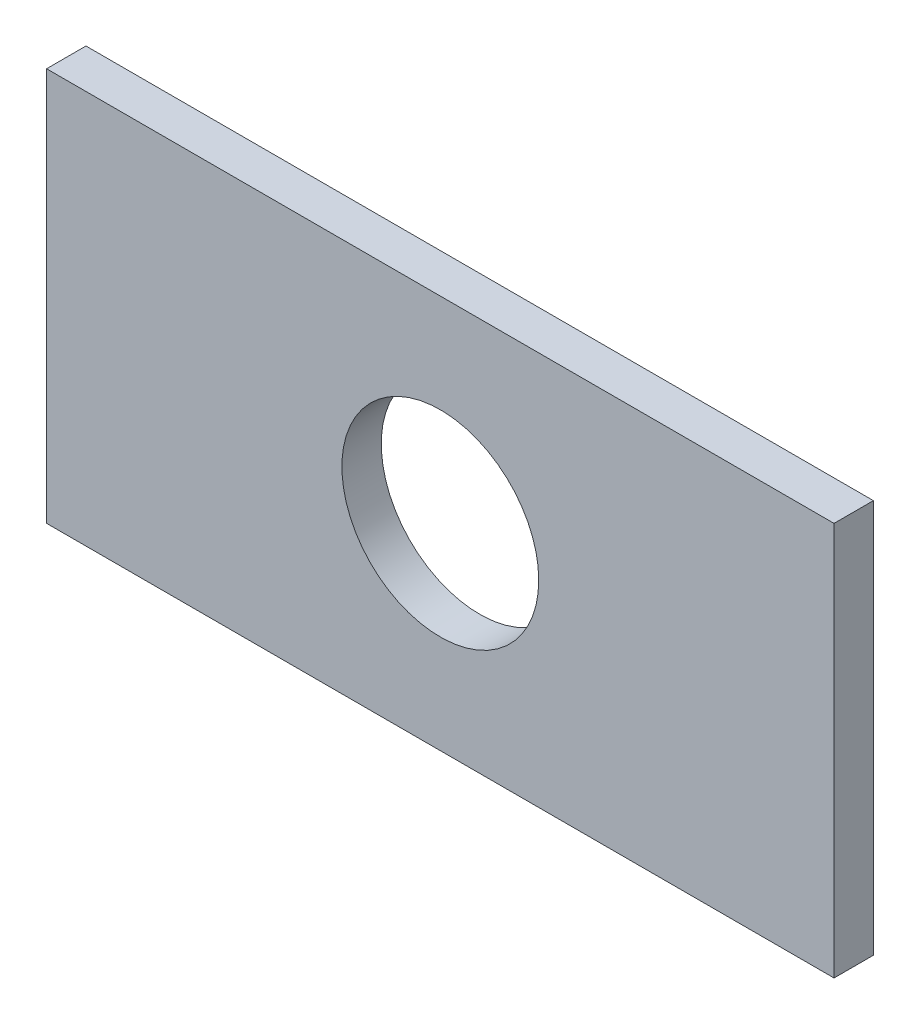
ISO-10303-21;
HEADER;
FILE_DESCRIPTION(('STEP AP214'),'2;1');
FILE_NAME('part.step','',(''),(''),'','','');
FILE_SCHEMA(('AUTOMOTIVE_DESIGN { 1 0 10303 214 1 1 1 1 }'));
ENDSEC;
DATA;
#1=APPLICATION_CONTEXT('core data for automotive mechanical design processes');
#2=APPLICATION_PROTOCOL_DEFINITION('international standard','automotive_design',2000,#1);
#3=PRODUCT_CONTEXT('',#1,'mechanical');
#4=PRODUCT('Part','Part','',(#3));
#5=PRODUCT_RELATED_PRODUCT_CATEGORY('part','',(#4));
#6=PRODUCT_DEFINITION_FORMATION('','',#4);
#7=PRODUCT_DEFINITION_CONTEXT('part definition',#1,'design');
#8=PRODUCT_DEFINITION('design','',#6,#7);
#9=PRODUCT_DEFINITION_SHAPE('','',#8);
#10=(LENGTH_UNIT() NAMED_UNIT(*) SI_UNIT(.MILLI.,.METRE.));
#11=(NAMED_UNIT(*) PLANE_ANGLE_UNIT() SI_UNIT($,.RADIAN.));
#12=(NAMED_UNIT(*) SI_UNIT($,.STERADIAN.) SOLID_ANGLE_UNIT());
#13=UNCERTAINTY_MEASURE_WITH_UNIT(LENGTH_MEASURE(1.E-05),#10,'distance_accuracy_value','');
#14=(GEOMETRIC_REPRESENTATION_CONTEXT(3) GLOBAL_UNCERTAINTY_ASSIGNED_CONTEXT((#13)) GLOBAL_UNIT_ASSIGNED_CONTEXT((#10,
#11,#12)) REPRESENTATION_CONTEXT('',''));
#15=CARTESIAN_POINT('',(0.,0.,0.));
#16=DIRECTION('',(0.,0.,1.));
#17=DIRECTION('',(1.,0.,0.));
#18=AXIS2_PLACEMENT_3D('',#15,#16,#17);
#19=CARTESIAN_POINT('',(0.,0.,127.));
#20=DIRECTION('',(0.,0.,-1.));
#21=DIRECTION('',(-1.,0.,0.));
#22=AXIS2_PLACEMENT_3D('',#19,#20,#21);
#23=PLANE('',#22);
#24=DIRECTION('',(0.,-1.,0.));
#25=VECTOR('',#24,1.);
#26=CARTESIAN_POINT('',(-2540.,1270.,127.));
#27=LINE('',#26,#25);
#28=CARTESIAN_POINT('',(-2540.,1270.,127.));
#29=VERTEX_POINT('',#28);
#30=CARTESIAN_POINT('',(-2540.,-1270.,127.));
#31=VERTEX_POINT('',#30);
#32=EDGE_CURVE('E85',#29,#31,#27,.T.);
#33=ORIENTED_EDGE('',*,*,#32,.T.);
#34=DIRECTION('',(1.,0.,0.));
#35=VECTOR('',#34,1.);
#36=CARTESIAN_POINT('',(2540.,-1270.,127.));
#37=LINE('',#36,#35);
#38=CARTESIAN_POINT('',(2540.,-1270.,127.));
#39=VERTEX_POINT('',#38);
#40=EDGE_CURVE('E80',#31,#39,#37,.T.);
#41=ORIENTED_EDGE('',*,*,#40,.T.);
#42=DIRECTION('',(0.,1.,0.));
#43=VECTOR('',#42,1.);
#44=CARTESIAN_POINT('',(2540.,1270.,127.));
#45=LINE('',#44,#43);
#46=CARTESIAN_POINT('',(2540.,1270.,127.));
#47=VERTEX_POINT('',#46);
#48=EDGE_CURVE('E83',#39,#47,#45,.T.);
#49=ORIENTED_EDGE('',*,*,#48,.T.);
#50=DIRECTION('',(-1.,0.,0.));
#51=VECTOR('',#50,1.);
#52=CARTESIAN_POINT('',(2540.,1270.,127.));
#53=LINE('',#52,#51);
#54=EDGE_CURVE('E50',#47,#29,#53,.T.);
#55=ORIENTED_EDGE('',*,*,#54,.T.);
#56=EDGE_LOOP('',(#33,#41,#49,#55));
#57=FACE_BOUND('',#56,.T.);
#58=CARTESIAN_POINT('',(-4.44089209850063E-13,8.88178419700125E-13,127.));
#59=DIRECTION('',(0.,0.,1.));
#60=DIRECTION('',(1.,0.,0.));
#61=AXIS2_PLACEMENT_3D('',#58,#59,#60);
#62=CIRCLE('',#61,635.);
#63=CARTESIAN_POINT('',(635.,8.88178419700125E-13,127.));
#64=VERTEX_POINT('',#63);
#65=EDGE_CURVE('E100',#64,#64,#62,.T.);
#66=ORIENTED_EDGE('',*,*,#65,.F.);
#67=EDGE_LOOP('',(#66));
#68=FACE_BOUND('',#67,.T.);
#69=ADVANCED_FACE('F33',(#57,#68),#23,.F.);
#70=CARTESIAN_POINT('',(0.,0.,-127.));
#71=DIRECTION('',(0.,0.,-1.));
#72=DIRECTION('',(-1.,0.,0.));
#73=AXIS2_PLACEMENT_3D('',#70,#71,#72);
#74=PLANE('',#73);
#75=DIRECTION('',(0.,-1.,0.));
#76=VECTOR('',#75,1.);
#77=CARTESIAN_POINT('',(-2540.,1270.,-127.));
#78=LINE('',#77,#76);
#79=CARTESIAN_POINT('',(-2540.,1270.,-127.));
#80=VERTEX_POINT('',#79);
#81=CARTESIAN_POINT('',(-2540.,-1270.,-127.));
#82=VERTEX_POINT('',#81);
#83=EDGE_CURVE('E97',#80,#82,#78,.T.);
#84=ORIENTED_EDGE('',*,*,#83,.F.);
#85=DIRECTION('',(-1.,0.,0.));
#86=VECTOR('',#85,1.);
#87=CARTESIAN_POINT('',(2540.,1270.,-127.));
#88=LINE('',#87,#86);
#89=CARTESIAN_POINT('',(2540.,1270.,-127.));
#90=VERTEX_POINT('',#89);
#91=EDGE_CURVE('E73',#90,#80,#88,.T.);
#92=ORIENTED_EDGE('',*,*,#91,.F.);
#93=DIRECTION('',(0.,1.,0.));
#94=VECTOR('',#93,1.);
#95=CARTESIAN_POINT('',(2540.,1270.,-127.));
#96=LINE('',#95,#94);
#97=CARTESIAN_POINT('',(2540.,-1270.,-127.));
#98=VERTEX_POINT('',#97);
#99=EDGE_CURVE('E67',#98,#90,#96,.T.);
#100=ORIENTED_EDGE('',*,*,#99,.F.);
#101=DIRECTION('',(1.,0.,0.));
#102=VECTOR('',#101,1.);
#103=CARTESIAN_POINT('',(2540.,-1270.,-127.));
#104=LINE('',#103,#102);
#105=EDGE_CURVE('E89',#82,#98,#104,.T.);
#106=ORIENTED_EDGE('',*,*,#105,.F.);
#107=EDGE_LOOP('',(#84,#92,#100,#106));
#108=FACE_BOUND('',#107,.T.);
#109=CARTESIAN_POINT('',(-4.44089209850063E-13,8.88178419700125E-13,-127.));
#110=DIRECTION('',(0.,0.,1.));
#111=DIRECTION('',(1.,0.,0.));
#112=AXIS2_PLACEMENT_3D('',#109,#110,#111);
#113=CIRCLE('',#112,635.);
#114=CARTESIAN_POINT('',(635.,8.88178419700125E-13,-127.));
#115=VERTEX_POINT('',#114);
#116=EDGE_CURVE('E112',#115,#115,#113,.T.);
#117=ORIENTED_EDGE('',*,*,#116,.T.);
#118=EDGE_LOOP('',(#117));
#119=FACE_BOUND('',#118,.T.);
#120=ADVANCED_FACE('F108',(#108,#119),#74,.T.);
#121=CARTESIAN_POINT('',(-2540.,1270.,127.));
#122=DIRECTION('',(1.,0.,0.));
#123=DIRECTION('',(0.,1.,0.));
#124=AXIS2_PLACEMENT_3D('',#121,#122,#123);
#125=PLANE('',#124);
#126=ORIENTED_EDGE('',*,*,#83,.T.);
#127=DIRECTION('',(0.,0.,-1.));
#128=VECTOR('',#127,1.);
#129=CARTESIAN_POINT('',(-2540.,-1270.,127.));
#130=LINE('',#129,#128);
#131=EDGE_CURVE('E11',#31,#82,#130,.T.);
#132=ORIENTED_EDGE('',*,*,#131,.F.);
#133=ORIENTED_EDGE('',*,*,#32,.F.);
#134=DIRECTION('',(0.,0.,-1.));
#135=VECTOR('',#134,1.);
#136=CARTESIAN_POINT('',(-2540.,1270.,127.));
#137=LINE('',#136,#135);
#138=EDGE_CURVE('E93',#29,#80,#137,.T.);
#139=ORIENTED_EDGE('',*,*,#138,.T.);
#140=EDGE_LOOP('',(#126,#132,#133,#139));
#141=FACE_BOUND('',#140,.T.);
#142=ADVANCED_FACE('F35',(#141),#125,.F.);
#143=CARTESIAN_POINT('',(2540.,-1270.,127.));
#144=DIRECTION('',(0.,1.,0.));
#145=DIRECTION('',(-1.,0.,0.));
#146=AXIS2_PLACEMENT_3D('',#143,#144,#145);
#147=PLANE('',#146);
#148=ORIENTED_EDGE('',*,*,#105,.T.);
#149=DIRECTION('',(0.,0.,-1.));
#150=VECTOR('',#149,1.);
#151=CARTESIAN_POINT('',(2540.,-1270.,127.));
#152=LINE('',#151,#150);
#153=EDGE_CURVE('E42',#39,#98,#152,.T.);
#154=ORIENTED_EDGE('',*,*,#153,.F.);
#155=ORIENTED_EDGE('',*,*,#40,.F.);
#156=ORIENTED_EDGE('',*,*,#131,.T.);
#157=EDGE_LOOP('',(#148,#154,#155,#156));
#158=FACE_BOUND('',#157,.T.);
#159=ADVANCED_FACE('F88',(#158),#147,.F.);
#160=CARTESIAN_POINT('',(2540.,1270.,127.));
#161=DIRECTION('',(-1.,0.,0.));
#162=DIRECTION('',(0.,-1.,0.));
#163=AXIS2_PLACEMENT_3D('',#160,#161,#162);
#164=PLANE('',#163);
#165=ORIENTED_EDGE('',*,*,#99,.T.);
#166=DIRECTION('',(0.,0.,-1.));
#167=VECTOR('',#166,1.);
#168=CARTESIAN_POINT('',(2540.,1270.,127.));
#169=LINE('',#168,#167);
#170=EDGE_CURVE('E90',#47,#90,#169,.T.);
#171=ORIENTED_EDGE('',*,*,#170,.F.);
#172=ORIENTED_EDGE('',*,*,#48,.F.);
#173=ORIENTED_EDGE('',*,*,#153,.T.);
#174=EDGE_LOOP('',(#165,#171,#172,#173));
#175=FACE_BOUND('',#174,.T.);
#176=ADVANCED_FACE('F91',(#175),#164,.F.);
#177=CARTESIAN_POINT('',(2540.,1270.,127.));
#178=DIRECTION('',(0.,-1.,0.));
#179=DIRECTION('',(1.,0.,0.));
#180=AXIS2_PLACEMENT_3D('',#177,#178,#179);
#181=PLANE('',#180);
#182=ORIENTED_EDGE('',*,*,#91,.T.);
#183=ORIENTED_EDGE('',*,*,#138,.F.);
#184=ORIENTED_EDGE('',*,*,#54,.F.);
#185=ORIENTED_EDGE('',*,*,#170,.T.);
#186=EDGE_LOOP('',(#182,#183,#184,#185));
#187=FACE_BOUND('',#186,.T.);
#188=ADVANCED_FACE('F105',(#187),#181,.F.);
#189=CARTESIAN_POINT('',(-4.44089209850063E-13,8.88178419700125E-13,127.));
#190=DIRECTION('',(0.,0.,-1.));
#191=DIRECTION('',(-1.,0.,0.));
#192=AXIS2_PLACEMENT_3D('',#189,#190,#191);
#193=CYLINDRICAL_SURFACE('',#192,635.);
#194=ORIENTED_EDGE('',*,*,#65,.T.);
#195=EDGE_LOOP('',(#194));
#196=FACE_BOUND('',#195,.T.);
#197=ORIENTED_EDGE('',*,*,#116,.F.);
#198=EDGE_LOOP('',(#197));
#199=FACE_BOUND('',#198,.T.);
#200=ADVANCED_FACE('F118',(#196,#199),#193,.F.);
#201=CLOSED_SHELL('',(#69,#120,#142,#159,#176,#188,#200));
#202=MANIFOLD_SOLID_BREP('B2',#201);
#203=ADVANCED_BREP_SHAPE_REPRESENTATION('',(#18,#202),#14);
#204=SHAPE_DEFINITION_REPRESENTATION(#9,#203);
ENDSEC;
END-ISO-10303-21;
